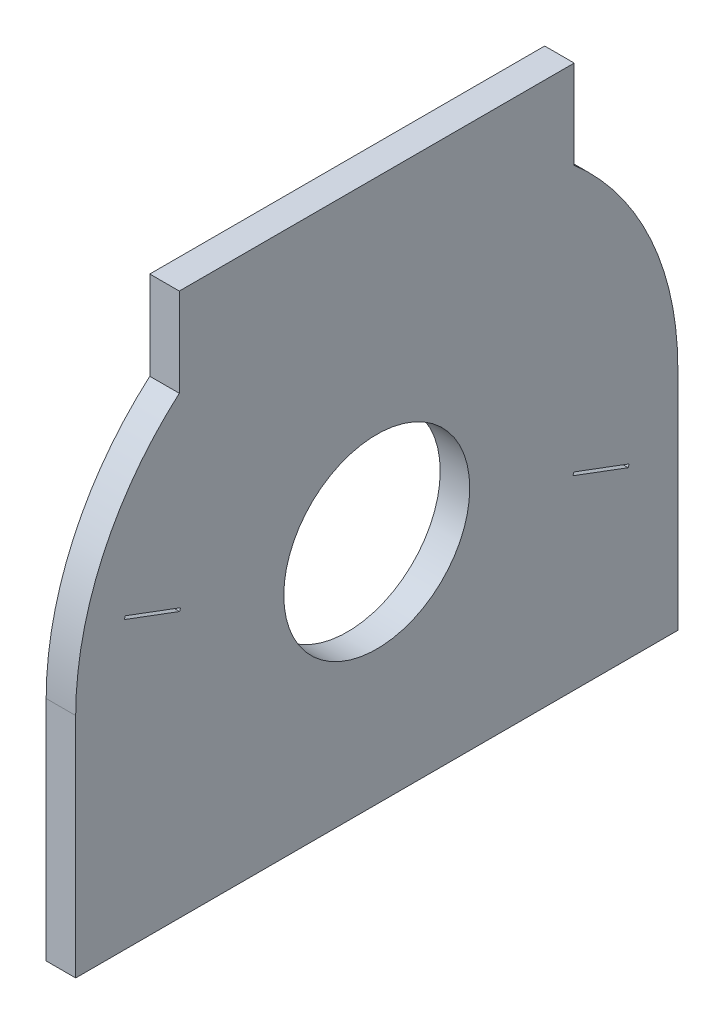
ISO-10303-21;
HEADER;
FILE_DESCRIPTION(('STEP AP214'),'2;1');
FILE_NAME('part.step','',(''),(''),'','','');
FILE_SCHEMA(('AUTOMOTIVE_DESIGN { 1 0 10303 214 1 1 1 1 }'));
ENDSEC;
DATA;
#1=APPLICATION_CONTEXT('core data for automotive mechanical design processes');
#2=APPLICATION_PROTOCOL_DEFINITION('international standard','automotive_design',2000,#1);
#3=PRODUCT_CONTEXT('',#1,'mechanical');
#4=PRODUCT('Part','Part','',(#3));
#5=PRODUCT_RELATED_PRODUCT_CATEGORY('part','',(#4));
#6=PRODUCT_DEFINITION_FORMATION('','',#4);
#7=PRODUCT_DEFINITION_CONTEXT('part definition',#1,'design');
#8=PRODUCT_DEFINITION('design','',#6,#7);
#9=PRODUCT_DEFINITION_SHAPE('','',#8);
#10=(LENGTH_UNIT() NAMED_UNIT(*) SI_UNIT(.MILLI.,.METRE.));
#11=(NAMED_UNIT(*) PLANE_ANGLE_UNIT() SI_UNIT($,.RADIAN.));
#12=(NAMED_UNIT(*) SI_UNIT($,.STERADIAN.) SOLID_ANGLE_UNIT());
#13=UNCERTAINTY_MEASURE_WITH_UNIT(LENGTH_MEASURE(1.E-05),#10,'distance_accuracy_value','');
#14=(GEOMETRIC_REPRESENTATION_CONTEXT(3) GLOBAL_UNCERTAINTY_ASSIGNED_CONTEXT((#13)) GLOBAL_UNIT_ASSIGNED_CONTEXT((#10,
#11,#12)) REPRESENTATION_CONTEXT('',''));
#15=CARTESIAN_POINT('',(0.,0.,0.));
#16=DIRECTION('',(0.,0.,1.));
#17=DIRECTION('',(1.,0.,0.));
#18=AXIS2_PLACEMENT_3D('',#15,#16,#17);
#19=CARTESIAN_POINT('',(-13.55,-11.6,0.));
#20=DIRECTION('',(-1.,0.,0.));
#21=DIRECTION('',(0.,0.,1.));
#22=AXIS2_PLACEMENT_3D('',#19,#20,#21);
#23=PLANE('',#22);
#24=CARTESIAN_POINT('',(-13.55,-11.6,0.));
#25=DIRECTION('',(-1.,0.,0.));
#26=DIRECTION('',(0.,0.,1.));
#27=AXIS2_PLACEMENT_3D('',#24,#25,#26);
#28=CIRCLE('',#27,3.15);
#29=CARTESIAN_POINT('',(-13.55,-11.6,3.15));
#30=VERTEX_POINT('',#29);
#31=EDGE_CURVE('E19',#30,#30,#28,.F.);
#32=ORIENTED_EDGE('',*,*,#31,.T.);
#33=EDGE_LOOP('',(#32));
#34=FACE_BOUND('',#33,.T.);
#35=DIRECTION('',(0.,0.936672189248387,-0.350207381259495));
#36=VECTOR('',#35,1.);
#37=CARTESIAN_POINT('',(-13.55,-9.512959009278,8.519161820185));
#38=LINE('',#37,#36);
#39=CARTESIAN_POINT('',(-13.55,-9.606626228203,8.55418255831101));
#40=VERTEX_POINT('',#39);
#41=CARTESIAN_POINT('',(-13.55,-9.51295900927981,8.51916182018568));
#42=VERTEX_POINT('',#41);
#43=EDGE_CURVE('E211',#40,#42,#38,.T.);
#44=ORIENTED_EDGE('',*,*,#43,.F.);
#45=DIRECTION('',(0.,0.350207381259495,0.936672189248387));
#46=VECTOR('',#45,1.);
#47=CARTESIAN_POINT('',(-13.55,-9.606626228203,8.554182558311));
#48=LINE('',#47,#46);
#49=CARTESIAN_POINT('',(-13.55,-10.3070409907207,6.68083817981524));
#50=VERTEX_POINT('',#49);
#51=EDGE_CURVE('E195',#50,#40,#48,.T.);
#52=ORIENTED_EDGE('',*,*,#51,.F.);
#53=DIRECTION('',(0.,-0.936672189248387,0.350207381259495));
#54=VECTOR('',#53,1.);
#55=CARTESIAN_POINT('',(-13.55,-10.30704099072,6.680838179815));
#56=LINE('',#55,#54);
#57=CARTESIAN_POINT('',(-13.55,-10.2133737717996,6.64581744169002));
#58=VERTEX_POINT('',#57);
#59=EDGE_CURVE('E92',#58,#50,#56,.T.);
#60=ORIENTED_EDGE('',*,*,#59,.F.);
#61=DIRECTION('',(0.,-0.350207381259495,-0.936672189248387));
#62=VECTOR('',#61,1.);
#63=CARTESIAN_POINT('',(-13.55,-10.2133737718,6.645817441689));
#64=LINE('',#63,#62);
#65=EDGE_CURVE('E217',#42,#58,#64,.T.);
#66=ORIENTED_EDGE('',*,*,#65,.F.);
#67=EDGE_LOOP('',(#44,#52,#60,#66));
#68=FACE_BOUND('',#67,.T.);
#69=DIRECTION('',(0.,0.936672189248387,-0.350207381259495));
#70=VECTOR('',#69,1.);
#71=CARTESIAN_POINT('',(-13.55,-12.89295900928,-6.680838179815));
#72=LINE('',#71,#70);
#73=CARTESIAN_POINT('',(-13.55,-12.9866262282004,-6.64581744169002));
#74=VERTEX_POINT('',#73);
#75=CARTESIAN_POINT('',(-13.55,-12.8929590092807,-6.68083817981473));
#76=VERTEX_POINT('',#75);
#77=EDGE_CURVE('E230',#74,#76,#72,.T.);
#78=ORIENTED_EDGE('',*,*,#77,.F.);
#79=DIRECTION('',(0.,0.350207381259495,0.936672189248387));
#80=VECTOR('',#79,1.);
#81=CARTESIAN_POINT('',(-13.55,-12.9866262282,-6.645817441689));
#82=LINE('',#81,#80);
#83=CARTESIAN_POINT('',(-13.55,-13.6870409907195,-8.51916182018518));
#84=VERTEX_POINT('',#83);
#85=EDGE_CURVE('E121',#84,#74,#82,.T.);
#86=ORIENTED_EDGE('',*,*,#85,.F.);
#87=DIRECTION('',(0.,-0.936672189248387,0.350207381259495));
#88=VECTOR('',#87,1.);
#89=CARTESIAN_POINT('',(-13.55,-13.68704099072,-8.519161820185));
#90=LINE('',#89,#88);
#91=CARTESIAN_POINT('',(-13.55,-13.5933737717996,-8.55418255830998));
#92=VERTEX_POINT('',#91);
#93=EDGE_CURVE('E118',#92,#84,#90,.T.);
#94=ORIENTED_EDGE('',*,*,#93,.F.);
#95=DIRECTION('',(0.,-0.350207381259495,-0.936672189248387));
#96=VECTOR('',#95,1.);
#97=CARTESIAN_POINT('',(-13.55,-13.5933737718,-8.554182558311));
#98=LINE('',#97,#96);
#99=EDGE_CURVE('E115',#76,#92,#98,.T.);
#100=ORIENTED_EDGE('',*,*,#99,.F.);
#101=EDGE_LOOP('',(#78,#86,#94,#100));
#102=FACE_BOUND('',#101,.T.);
#103=CARTESIAN_POINT('',(-13.55,-11.6,0.));
#104=DIRECTION('',(-1.,0.,0.));
#105=DIRECTION('',(0.,0.,1.));
#106=AXIS2_PLACEMENT_3D('',#103,#104,#105);
#107=CIRCLE('',#106,10.2);
#108=CARTESIAN_POINT('',(-13.55,-11.6,-10.2));
#109=VERTEX_POINT('',#108);
#110=CARTESIAN_POINT('',(-13.55,-3.90000000000013,-6.68954408012998));
#111=VERTEX_POINT('',#110);
#112=EDGE_CURVE('E188',#109,#111,#107,.F.);
#113=ORIENTED_EDGE('',*,*,#112,.F.);
#114=DIRECTION('',(0.,1.,0.));
#115=VECTOR('',#114,1.);
#116=CARTESIAN_POINT('',(-13.55,-22.9,-10.2));
#117=LINE('',#116,#115);
#118=CARTESIAN_POINT('',(-13.55,-19.3,-10.2));
#119=VERTEX_POINT('',#118);
#120=EDGE_CURVE('E154',#119,#109,#117,.T.);
#121=ORIENTED_EDGE('',*,*,#120,.F.);
#122=DIRECTION('',(0.,0.,1.));
#123=VECTOR('',#122,1.);
#124=CARTESIAN_POINT('',(-13.55,-19.3,14.3153457059952));
#125=LINE('',#124,#123);
#126=CARTESIAN_POINT('',(-13.55,-19.3,10.2));
#127=VERTEX_POINT('',#126);
#128=EDGE_CURVE('E149',#119,#127,#125,.T.);
#129=ORIENTED_EDGE('',*,*,#128,.T.);
#130=DIRECTION('',(0.,1.,0.));
#131=VECTOR('',#130,1.);
#132=CARTESIAN_POINT('',(-13.55,-11.6,10.2));
#133=LINE('',#132,#131);
#134=CARTESIAN_POINT('',(-13.55,-11.6,10.2));
#135=VERTEX_POINT('',#134);
#136=EDGE_CURVE('E144',#135,#127,#133,.F.);
#137=ORIENTED_EDGE('',*,*,#136,.F.);
#138=CARTESIAN_POINT('',(-13.55,-11.6,0.));
#139=DIRECTION('',(-1.,0.,0.));
#140=DIRECTION('',(0.,0.,1.));
#141=AXIS2_PLACEMENT_3D('',#138,#139,#140);
#142=CIRCLE('',#141,10.2);
#143=CARTESIAN_POINT('',(-13.55,-3.90000000000011,6.68954408013));
#144=VERTEX_POINT('',#143);
#145=EDGE_CURVE('E172',#144,#135,#142,.F.);
#146=ORIENTED_EDGE('',*,*,#145,.F.);
#147=DIRECTION('',(0.,1.,0.));
#148=VECTOR('',#147,1.);
#149=CARTESIAN_POINT('',(-13.55,-3.9,6.68954408013));
#150=LINE('',#149,#148);
#151=CARTESIAN_POINT('',(-13.55,-0.9,6.68954408013));
#152=VERTEX_POINT('',#151);
#153=EDGE_CURVE('E83',#152,#144,#150,.F.);
#154=ORIENTED_EDGE('',*,*,#153,.F.);
#155=DIRECTION('',(0.,0.,1.));
#156=VECTOR('',#155,1.);
#157=CARTESIAN_POINT('',(-13.55,-0.9,6.68954408013));
#158=LINE('',#157,#156);
#159=CARTESIAN_POINT('',(-13.55,-0.9,-6.68954408013));
#160=VERTEX_POINT('',#159);
#161=EDGE_CURVE('E166',#160,#152,#158,.T.);
#162=ORIENTED_EDGE('',*,*,#161,.F.);
#163=DIRECTION('',(0.,1.,0.));
#164=VECTOR('',#163,1.);
#165=CARTESIAN_POINT('',(-13.55,-0.9,-6.68954408013));
#166=LINE('',#165,#164);
#167=EDGE_CURVE('E160',#111,#160,#166,.T.);
#168=ORIENTED_EDGE('',*,*,#167,.F.);
#169=EDGE_LOOP('',(#113,#121,#129,#137,#146,#154,#162,#168));
#170=FACE_BOUND('',#169,.T.);
#171=ADVANCED_FACE('F16',(#34,#68,#102,#170),#23,.T.);
#172=CARTESIAN_POINT('',(-12.55,-13.68704099072,-8.519161820185));
#173=DIRECTION('',(0.,0.350207381259495,0.936672189248387));
#174=DIRECTION('',(0.,-0.936672189248387,0.350207381259495));
#175=AXIS2_PLACEMENT_3D('',#172,#173,#174);
#176=PLANE('',#175);
#177=DIRECTION('',(1.,0.,0.));
#178=VECTOR('',#177,1.);
#179=CARTESIAN_POINT('',(-12.55,-13.5933737717998,-8.55418255831059));
#180=LINE('',#179,#178);
#181=CARTESIAN_POINT('',(-12.55,-13.5933737717996,-8.55418255830998));
#182=VERTEX_POINT('',#181);
#183=EDGE_CURVE('E126',#92,#182,#180,.T.);
#184=ORIENTED_EDGE('',*,*,#183,.F.);
#185=ORIENTED_EDGE('',*,*,#93,.T.);
#186=DIRECTION('',(1.,0.,0.));
#187=VECTOR('',#186,1.);
#188=CARTESIAN_POINT('',(-12.55,-13.6870409907189,-8.51916182018543));
#189=LINE('',#188,#187);
#190=CARTESIAN_POINT('',(-12.55,-13.6870409907194,-8.51916182018521));
#191=VERTEX_POINT('',#190);
#192=EDGE_CURVE('E225',#191,#84,#189,.F.);
#193=ORIENTED_EDGE('',*,*,#192,.F.);
#194=DIRECTION('',(0.,0.936672189243805,-0.35020738127175));
#195=VECTOR('',#194,1.);
#196=CARTESIAN_POINT('',(-12.55,-13.6870409907194,-8.51916182018521));
#197=LINE('',#196,#195);
#198=EDGE_CURVE('E140',#191,#182,#197,.T.);
#199=ORIENTED_EDGE('',*,*,#198,.T.);
#200=EDGE_LOOP('',(#184,#185,#193,#199));
#201=FACE_BOUND('',#200,.T.);
#202=ADVANCED_FACE('F138',(#201),#176,.T.);
#203=CARTESIAN_POINT('',(-12.55,-13.5933737718,-8.554182558311));
#204=DIRECTION('',(0.,-0.936672189248387,0.350207381259495));
#205=DIRECTION('',(0.,-0.350207381259495,-0.936672189248387));
#206=AXIS2_PLACEMENT_3D('',#203,#204,#205);
#207=PLANE('',#206);
#208=DIRECTION('',(1.,0.,0.));
#209=VECTOR('',#208,1.);
#210=CARTESIAN_POINT('',(-12.55,-12.8929590092803,-6.68083817981489));
#211=LINE('',#210,#209);
#212=CARTESIAN_POINT('',(-12.55,-12.8929590092808,-6.68083817981471));
#213=VERTEX_POINT('',#212);
#214=EDGE_CURVE('E135',#76,#213,#211,.T.);
#215=ORIENTED_EDGE('',*,*,#214,.F.);
#216=ORIENTED_EDGE('',*,*,#99,.T.);
#217=ORIENTED_EDGE('',*,*,#183,.T.);
#218=DIRECTION('',(0.,0.35020738125978,0.936672189248281));
#219=VECTOR('',#218,1.);
#220=CARTESIAN_POINT('',(-12.55,-13.5933737717998,-8.55418255831059));
#221=LINE('',#220,#219);
#222=EDGE_CURVE('E243',#182,#213,#221,.T.);
#223=ORIENTED_EDGE('',*,*,#222,.T.);
#224=EDGE_LOOP('',(#215,#216,#217,#223));
#225=FACE_BOUND('',#224,.T.);
#226=ADVANCED_FACE('F131',(#225),#207,.T.);
#227=CARTESIAN_POINT('',(-12.55,-12.89295900928,-6.680838179815));
#228=DIRECTION('',(0.,-0.350207381259495,-0.936672189248387));
#229=DIRECTION('',(0.,0.936672189248387,-0.350207381259495));
#230=AXIS2_PLACEMENT_3D('',#227,#228,#229);
#231=PLANE('',#230);
#232=DIRECTION('',(1.,0.,0.));
#233=VECTOR('',#232,1.);
#234=CARTESIAN_POINT('',(-12.55,-12.9866262282002,-6.64581744168941));
#235=LINE('',#234,#233);
#236=CARTESIAN_POINT('',(-12.55,-12.9866262282004,-6.64581744169012));
#237=VERTEX_POINT('',#236);
#238=EDGE_CURVE('E227',#74,#237,#235,.T.);
#239=ORIENTED_EDGE('',*,*,#238,.F.);
#240=ORIENTED_EDGE('',*,*,#77,.T.);
#241=ORIENTED_EDGE('',*,*,#214,.T.);
#242=DIRECTION('',(0.,-0.936672189245345,0.350207381267631));
#243=VECTOR('',#242,1.);
#244=CARTESIAN_POINT('',(-12.55,-12.8929590092806,-6.68083817981479));
#245=LINE('',#244,#243);
#246=EDGE_CURVE('E238',#213,#237,#245,.T.);
#247=ORIENTED_EDGE('',*,*,#246,.T.);
#248=EDGE_LOOP('',(#239,#240,#241,#247));
#249=FACE_BOUND('',#248,.T.);
#250=ADVANCED_FACE('F236',(#249),#231,.T.);
#251=CARTESIAN_POINT('',(-12.55,-12.9866262282,-6.645817441689));
#252=DIRECTION('',(0.,0.936672189248387,-0.350207381259495));
#253=DIRECTION('',(0.,0.350207381259495,0.936672189248387));
#254=AXIS2_PLACEMENT_3D('',#251,#252,#253);
#255=PLANE('',#254);
#256=ORIENTED_EDGE('',*,*,#192,.T.);
#257=ORIENTED_EDGE('',*,*,#85,.T.);
#258=ORIENTED_EDGE('',*,*,#238,.T.);
#259=DIRECTION('',(0.,-0.350207381259779,-0.936672189248281));
#260=VECTOR('',#259,1.);
#261=CARTESIAN_POINT('',(-12.55,-12.9866262282003,-6.64581744168982));
#262=LINE('',#261,#260);
#263=EDGE_CURVE('E245',#237,#191,#262,.T.);
#264=ORIENTED_EDGE('',*,*,#263,.T.);
#265=EDGE_LOOP('',(#256,#257,#258,#264));
#266=FACE_BOUND('',#265,.T.);
#267=ADVANCED_FACE('F307',(#266),#255,.T.);
#268=CARTESIAN_POINT('',(-12.55,-10.30704099072,6.680838179815));
#269=DIRECTION('',(0.,0.350207381259495,0.936672189248387));
#270=DIRECTION('',(0.,-0.936672189248387,0.350207381259495));
#271=AXIS2_PLACEMENT_3D('',#268,#269,#270);
#272=PLANE('',#271);
#273=DIRECTION('',(1.,0.,0.));
#274=VECTOR('',#273,1.);
#275=CARTESIAN_POINT('',(-12.55,-10.2133737717998,6.64581744168941));
#276=LINE('',#275,#274);
#277=CARTESIAN_POINT('',(-12.55,-10.2133737717996,6.64581744169002));
#278=VERTEX_POINT('',#277);
#279=EDGE_CURVE('E220',#58,#278,#276,.T.);
#280=ORIENTED_EDGE('',*,*,#279,.F.);
#281=ORIENTED_EDGE('',*,*,#59,.T.);
#282=DIRECTION('',(1.,0.,0.));
#283=VECTOR('',#282,1.);
#284=CARTESIAN_POINT('',(-12.55,-10.3070409907215,6.68083817981556));
#285=LINE('',#284,#283);
#286=CARTESIAN_POINT('',(-12.55,-10.3070409907207,6.68083817981528));
#287=VERTEX_POINT('',#286);
#288=EDGE_CURVE('E199',#287,#50,#285,.F.);
#289=ORIENTED_EDGE('',*,*,#288,.F.);
#290=DIRECTION('',(0.,0.93667218924381,-0.350207381271738));
#291=VECTOR('',#290,1.);
#292=CARTESIAN_POINT('',(-12.55,-10.3070409907207,6.68083817981528));
#293=LINE('',#292,#291);
#294=EDGE_CURVE('E303',#287,#278,#293,.T.);
#295=ORIENTED_EDGE('',*,*,#294,.T.);
#296=EDGE_LOOP('',(#280,#281,#289,#295));
#297=FACE_BOUND('',#296,.T.);
#298=ADVANCED_FACE('F327',(#297),#272,.T.);
#299=CARTESIAN_POINT('',(-12.55,-10.2133737718,6.645817441689));
#300=DIRECTION('',(0.,-0.936672189248387,0.350207381259495));
#301=DIRECTION('',(0.,-0.350207381259495,-0.936672189248387));
#302=AXIS2_PLACEMENT_3D('',#299,#300,#301);
#303=PLANE('',#302);
#304=DIRECTION('',(1.,0.,0.));
#305=VECTOR('',#304,1.);
#306=CARTESIAN_POINT('',(-12.55,-9.51295900927872,8.51916182018527));
#307=LINE('',#306,#305);
#308=CARTESIAN_POINT('',(-12.55,-9.51295900927999,8.51916182018574));
#309=VERTEX_POINT('',#308);
#310=EDGE_CURVE('E214',#42,#309,#307,.T.);
#311=ORIENTED_EDGE('',*,*,#310,.F.);
#312=ORIENTED_EDGE('',*,*,#65,.T.);
#313=ORIENTED_EDGE('',*,*,#279,.T.);
#314=DIRECTION('',(0.,0.350207381260219,0.936672189248117));
#315=VECTOR('',#314,1.);
#316=CARTESIAN_POINT('',(-12.55,-10.2133737717998,6.64581744168941));
#317=LINE('',#316,#315);
#318=EDGE_CURVE('E300',#278,#309,#317,.T.);
#319=ORIENTED_EDGE('',*,*,#318,.T.);
#320=EDGE_LOOP('',(#311,#312,#313,#319));
#321=FACE_BOUND('',#320,.T.);
#322=ADVANCED_FACE('F326',(#321),#303,.T.);
#323=CARTESIAN_POINT('',(-12.55,-9.512959009278,8.519161820185));
#324=DIRECTION('',(0.,-0.350207381259495,-0.936672189248387));
#325=DIRECTION('',(0.,0.936672189248387,-0.350207381259495));
#326=AXIS2_PLACEMENT_3D('',#323,#324,#325);
#327=PLANE('',#326);
#328=DIRECTION('',(1.,0.,0.));
#329=VECTOR('',#328,1.);
#330=CARTESIAN_POINT('',(-12.55,-9.606626228203,8.554182558311));
#331=LINE('',#330,#329);
#332=CARTESIAN_POINT('',(-12.55,-9.606626228203,8.55418255831101));
#333=VERTEX_POINT('',#332);
#334=EDGE_CURVE('E205',#40,#333,#331,.T.);
#335=ORIENTED_EDGE('',*,*,#334,.F.);
#336=ORIENTED_EDGE('',*,*,#43,.T.);
#337=ORIENTED_EDGE('',*,*,#310,.T.);
#338=DIRECTION('',(0.,-0.936672189248402,0.350207381259455));
#339=VECTOR('',#338,1.);
#340=CARTESIAN_POINT('',(-12.55,-9.51295900927945,8.51916182018554));
#341=LINE('',#340,#339);
#342=EDGE_CURVE('E297',#309,#333,#341,.T.);
#343=ORIENTED_EDGE('',*,*,#342,.T.);
#344=EDGE_LOOP('',(#335,#336,#337,#343));
#345=FACE_BOUND('',#344,.T.);
#346=ADVANCED_FACE('F323',(#345),#327,.T.);
#347=CARTESIAN_POINT('',(-12.55,-9.606626228203,8.554182558311));
#348=DIRECTION('',(0.,0.936672189248387,-0.350207381259495));
#349=DIRECTION('',(0.,0.350207381259495,0.936672189248387));
#350=AXIS2_PLACEMENT_3D('',#347,#348,#349);
#351=PLANE('',#350);
#352=ORIENTED_EDGE('',*,*,#288,.T.);
#353=ORIENTED_EDGE('',*,*,#51,.T.);
#354=ORIENTED_EDGE('',*,*,#334,.T.);
#355=DIRECTION('',(0.,-0.350207381259122,-0.936672189248527));
#356=VECTOR('',#355,1.);
#357=CARTESIAN_POINT('',(-12.55,-9.606626228203,8.554182558311));
#358=LINE('',#357,#356);
#359=EDGE_CURVE('E187',#333,#287,#358,.T.);
#360=ORIENTED_EDGE('',*,*,#359,.T.);
#361=EDGE_LOOP('',(#352,#353,#354,#360));
#362=FACE_BOUND('',#361,.T.);
#363=ADVANCED_FACE('F318',(#362),#351,.T.);
#364=CARTESIAN_POINT('',(-12.55,-11.6,0.));
#365=DIRECTION('',(-1.,0.,0.));
#366=DIRECTION('',(0.,0.,1.));
#367=AXIS2_PLACEMENT_3D('',#364,#365,#366);
#368=CYLINDRICAL_SURFACE('',#367,3.15);
#369=ORIENTED_EDGE('',*,*,#31,.F.);
#370=EDGE_LOOP('',(#369));
#371=FACE_BOUND('',#370,.T.);
#372=CARTESIAN_POINT('',(-12.55,-11.6,0.));
#373=DIRECTION('',(-1.,0.,0.));
#374=DIRECTION('',(0.,0.,1.));
#375=AXIS2_PLACEMENT_3D('',#372,#373,#374);
#376=CIRCLE('',#375,3.15);
#377=CARTESIAN_POINT('',(-12.55,-11.6,3.15));
#378=VERTEX_POINT('',#377);
#379=EDGE_CURVE('E184',#378,#378,#376,.F.);
#380=ORIENTED_EDGE('',*,*,#379,.T.);
#381=EDGE_LOOP('',(#380));
#382=FACE_BOUND('',#381,.T.);
#383=ADVANCED_FACE('F365',(#371,#382),#368,.F.);
#384=CARTESIAN_POINT('',(-12.55,-11.6,0.));
#385=DIRECTION('',(-1.,0.,0.));
#386=DIRECTION('',(0.,0.,1.));
#387=AXIS2_PLACEMENT_3D('',#384,#385,#386);
#388=CYLINDRICAL_SURFACE('',#387,10.2);
#389=CARTESIAN_POINT('',(-12.55,-11.6,0.));
#390=DIRECTION('',(-1.,0.,0.));
#391=DIRECTION('',(0.,0.,1.));
#392=AXIS2_PLACEMENT_3D('',#389,#390,#391);
#393=CIRCLE('',#392,10.2);
#394=CARTESIAN_POINT('',(-12.55,-11.6,10.2));
#395=VERTEX_POINT('',#394);
#396=CARTESIAN_POINT('',(-12.55,-3.90000000000011,6.68954408013));
#397=VERTEX_POINT('',#396);
#398=EDGE_CURVE('E180',#395,#397,#393,.T.);
#399=ORIENTED_EDGE('',*,*,#398,.T.);
#400=DIRECTION('',(1.,0.,0.));
#401=VECTOR('',#400,1.);
#402=CARTESIAN_POINT('',(-13.55,-3.90000000000008,6.68954408013));
#403=LINE('',#402,#401);
#404=EDGE_CURVE('E168',#144,#397,#403,.T.);
#405=ORIENTED_EDGE('',*,*,#404,.F.);
#406=ORIENTED_EDGE('',*,*,#145,.T.);
#407=DIRECTION('',(1.,0.,0.));
#408=VECTOR('',#407,1.);
#409=CARTESIAN_POINT('',(-12.55,-11.6,10.2));
#410=LINE('',#409,#408);
#411=EDGE_CURVE('E146',#395,#135,#410,.F.);
#412=ORIENTED_EDGE('',*,*,#411,.F.);
#413=EDGE_LOOP('',(#399,#405,#406,#412));
#414=FACE_BOUND('',#413,.T.);
#415=ADVANCED_FACE('F362',(#414),#388,.T.);
#416=CARTESIAN_POINT('',(-13.55,-3.9,6.68954408013));
#417=DIRECTION('',(0.,0.,1.));
#418=DIRECTION('',(1.,0.,0.));
#419=AXIS2_PLACEMENT_3D('',#416,#417,#418);
#420=PLANE('',#419);
#421=DIRECTION('',(0.,1.,0.));
#422=VECTOR('',#421,1.);
#423=CARTESIAN_POINT('',(-12.55,-11.6,6.68954408013));
#424=LINE('',#423,#422);
#425=CARTESIAN_POINT('',(-12.55,-0.9,6.68954408013));
#426=VERTEX_POINT('',#425);
#427=EDGE_CURVE('E183',#397,#426,#424,.T.);
#428=ORIENTED_EDGE('',*,*,#427,.T.);
#429=DIRECTION('',(1.,0.,0.));
#430=VECTOR('',#429,1.);
#431=CARTESIAN_POINT('',(-13.55,-0.9,6.68954408013));
#432=LINE('',#431,#430);
#433=EDGE_CURVE('E163',#152,#426,#432,.T.);
#434=ORIENTED_EDGE('',*,*,#433,.F.);
#435=ORIENTED_EDGE('',*,*,#153,.T.);
#436=ORIENTED_EDGE('',*,*,#404,.T.);
#437=EDGE_LOOP('',(#428,#434,#435,#436));
#438=FACE_BOUND('',#437,.T.);
#439=ADVANCED_FACE('F287',(#438),#420,.T.);
#440=CARTESIAN_POINT('',(-13.55,-0.9,6.68954408013));
#441=DIRECTION('',(0.,1.,0.));
#442=DIRECTION('',(0.,0.,1.));
#443=AXIS2_PLACEMENT_3D('',#440,#441,#442);
#444=PLANE('',#443);
#445=ORIENTED_EDGE('',*,*,#433,.T.);
#446=DIRECTION('',(0.,0.,1.));
#447=VECTOR('',#446,1.);
#448=CARTESIAN_POINT('',(-12.55,-0.9,0.));
#449=LINE('',#448,#447);
#450=CARTESIAN_POINT('',(-12.55,-0.9,-6.68954408013));
#451=VERTEX_POINT('',#450);
#452=EDGE_CURVE('E268',#426,#451,#449,.F.);
#453=ORIENTED_EDGE('',*,*,#452,.T.);
#454=DIRECTION('',(-1.,0.,0.));
#455=VECTOR('',#454,1.);
#456=CARTESIAN_POINT('',(-13.55,-0.9,-6.68954408013));
#457=LINE('',#456,#455);
#458=EDGE_CURVE('E162',#160,#451,#457,.F.);
#459=ORIENTED_EDGE('',*,*,#458,.F.);
#460=ORIENTED_EDGE('',*,*,#161,.T.);
#461=EDGE_LOOP('',(#445,#453,#459,#460));
#462=FACE_BOUND('',#461,.T.);
#463=ADVANCED_FACE('F276',(#462),#444,.T.);
#464=CARTESIAN_POINT('',(-13.55,-0.9,-6.68954408013));
#465=DIRECTION('',(0.,0.,-1.));
#466=DIRECTION('',(-1.,0.,0.));
#467=AXIS2_PLACEMENT_3D('',#464,#465,#466);
#468=PLANE('',#467);
#469=ORIENTED_EDGE('',*,*,#167,.T.);
#470=ORIENTED_EDGE('',*,*,#458,.T.);
#471=DIRECTION('',(0.,1.,0.));
#472=VECTOR('',#471,1.);
#473=CARTESIAN_POINT('',(-12.55,-11.6,-6.68954408013));
#474=LINE('',#473,#472);
#475=CARTESIAN_POINT('',(-12.55,-3.90000000000014,-6.68954408012998));
#476=VERTEX_POINT('',#475);
#477=EDGE_CURVE('E179',#451,#476,#474,.F.);
#478=ORIENTED_EDGE('',*,*,#477,.T.);
#479=DIRECTION('',(-1.,0.,0.));
#480=VECTOR('',#479,1.);
#481=CARTESIAN_POINT('',(-12.55,-3.90000000000012,-6.68954408012996));
#482=LINE('',#481,#480);
#483=EDGE_CURVE('E157',#111,#476,#482,.F.);
#484=ORIENTED_EDGE('',*,*,#483,.F.);
#485=EDGE_LOOP('',(#469,#470,#478,#484));
#486=FACE_BOUND('',#485,.T.);
#487=ADVANCED_FACE('F353',(#486),#468,.T.);
#488=CARTESIAN_POINT('',(-12.55,-11.6,0.));
#489=DIRECTION('',(-1.,0.,0.));
#490=DIRECTION('',(0.,0.,1.));
#491=AXIS2_PLACEMENT_3D('',#488,#489,#490);
#492=CYLINDRICAL_SURFACE('',#491,10.2);
#493=ORIENTED_EDGE('',*,*,#112,.T.);
#494=ORIENTED_EDGE('',*,*,#483,.T.);
#495=CARTESIAN_POINT('',(-12.55,-11.6,0.));
#496=DIRECTION('',(-1.,0.,0.));
#497=DIRECTION('',(0.,0.,1.));
#498=AXIS2_PLACEMENT_3D('',#495,#496,#497);
#499=CIRCLE('',#498,10.2);
#500=CARTESIAN_POINT('',(-12.55,-11.6,-10.2));
#501=VERTEX_POINT('',#500);
#502=EDGE_CURVE('E175',#476,#501,#499,.T.);
#503=ORIENTED_EDGE('',*,*,#502,.T.);
#504=DIRECTION('',(-1.,0.,0.));
#505=VECTOR('',#504,1.);
#506=CARTESIAN_POINT('',(-12.55,-11.6,-10.2));
#507=LINE('',#506,#505);
#508=EDGE_CURVE('E156',#109,#501,#507,.F.);
#509=ORIENTED_EDGE('',*,*,#508,.F.);
#510=EDGE_LOOP('',(#493,#494,#503,#509));
#511=FACE_BOUND('',#510,.T.);
#512=ADVANCED_FACE('F349',(#511),#492,.T.);
#513=CARTESIAN_POINT('',(-12.55,-22.9,-10.2));
#514=DIRECTION('',(0.,0.,-1.));
#515=DIRECTION('',(-1.,0.,0.));
#516=AXIS2_PLACEMENT_3D('',#513,#514,#515);
#517=PLANE('',#516);
#518=ORIENTED_EDGE('',*,*,#508,.T.);
#519=DIRECTION('',(0.,1.,0.));
#520=VECTOR('',#519,1.);
#521=CARTESIAN_POINT('',(-12.55,-11.6,-10.2));
#522=LINE('',#521,#520);
#523=CARTESIAN_POINT('',(-12.55,-19.3,-10.2));
#524=VERTEX_POINT('',#523);
#525=EDGE_CURVE('E178',#501,#524,#522,.F.);
#526=ORIENTED_EDGE('',*,*,#525,.T.);
#527=DIRECTION('',(1.,0.,0.));
#528=VECTOR('',#527,1.);
#529=CARTESIAN_POINT('',(26.2245314429007,-19.3,-10.2));
#530=LINE('',#529,#528);
#531=EDGE_CURVE('E151',#524,#119,#530,.F.);
#532=ORIENTED_EDGE('',*,*,#531,.T.);
#533=ORIENTED_EDGE('',*,*,#120,.T.);
#534=EDGE_LOOP('',(#518,#526,#532,#533));
#535=FACE_BOUND('',#534,.T.);
#536=ADVANCED_FACE('F345',(#535),#517,.T.);
#537=CARTESIAN_POINT('',(26.2245314429007,-19.3,14.3153457059952));
#538=DIRECTION('',(0.,1.,0.));
#539=DIRECTION('',(0.,0.,1.));
#540=AXIS2_PLACEMENT_3D('',#537,#538,#539);
#541=PLANE('',#540);
#542=ORIENTED_EDGE('',*,*,#128,.F.);
#543=ORIENTED_EDGE('',*,*,#531,.F.);
#544=DIRECTION('',(0.,0.,1.));
#545=VECTOR('',#544,1.);
#546=CARTESIAN_POINT('',(-12.55,-19.3,0.));
#547=LINE('',#546,#545);
#548=CARTESIAN_POINT('',(-12.55,-19.3,10.2));
#549=VERTEX_POINT('',#548);
#550=EDGE_CURVE('E25',#524,#549,#547,.T.);
#551=ORIENTED_EDGE('',*,*,#550,.T.);
#552=DIRECTION('',(1.,0.,0.));
#553=VECTOR('',#552,1.);
#554=CARTESIAN_POINT('',(-12.55,-19.3,10.2));
#555=LINE('',#554,#553);
#556=EDGE_CURVE('E33',#127,#549,#555,.T.);
#557=ORIENTED_EDGE('',*,*,#556,.F.);
#558=EDGE_LOOP('',(#542,#543,#551,#557));
#559=FACE_BOUND('',#558,.T.);
#560=ADVANCED_FACE('F340',(#559),#541,.F.);
#561=CARTESIAN_POINT('',(-12.55,-11.6,10.2));
#562=DIRECTION('',(0.,0.,1.));
#563=DIRECTION('',(1.,0.,0.));
#564=AXIS2_PLACEMENT_3D('',#561,#562,#563);
#565=PLANE('',#564);
#566=ORIENTED_EDGE('',*,*,#411,.T.);
#567=ORIENTED_EDGE('',*,*,#136,.T.);
#568=ORIENTED_EDGE('',*,*,#556,.T.);
#569=DIRECTION('',(0.,1.,0.));
#570=VECTOR('',#569,1.);
#571=CARTESIAN_POINT('',(-12.55,-11.6,10.2));
#572=LINE('',#571,#570);
#573=EDGE_CURVE('E11',#549,#395,#572,.T.);
#574=ORIENTED_EDGE('',*,*,#573,.T.);
#575=EDGE_LOOP('',(#566,#567,#568,#574));
#576=FACE_BOUND('',#575,.T.);
#577=ADVANCED_FACE('F335',(#576),#565,.T.);
#578=CARTESIAN_POINT('',(-12.55,-11.6,0.));
#579=DIRECTION('',(-1.,0.,0.));
#580=DIRECTION('',(0.,0.,1.));
#581=AXIS2_PLACEMENT_3D('',#578,#579,#580);
#582=PLANE('',#581);
#583=ORIENTED_EDGE('',*,*,#550,.F.);
#584=ORIENTED_EDGE('',*,*,#525,.F.);
#585=ORIENTED_EDGE('',*,*,#502,.F.);
#586=ORIENTED_EDGE('',*,*,#477,.F.);
#587=ORIENTED_EDGE('',*,*,#452,.F.);
#588=ORIENTED_EDGE('',*,*,#427,.F.);
#589=ORIENTED_EDGE('',*,*,#398,.F.);
#590=ORIENTED_EDGE('',*,*,#573,.F.);
#591=EDGE_LOOP('',(#583,#584,#585,#586,#587,#588,#589,#590));
#592=FACE_BOUND('',#591,.T.);
#593=ORIENTED_EDGE('',*,*,#379,.F.);
#594=EDGE_LOOP('',(#593));
#595=FACE_BOUND('',#594,.T.);
#596=ORIENTED_EDGE('',*,*,#342,.F.);
#597=ORIENTED_EDGE('',*,*,#318,.F.);
#598=ORIENTED_EDGE('',*,*,#294,.F.);
#599=ORIENTED_EDGE('',*,*,#359,.F.);
#600=EDGE_LOOP('',(#596,#597,#598,#599));
#601=FACE_BOUND('',#600,.T.);
#602=ORIENTED_EDGE('',*,*,#246,.F.);
#603=ORIENTED_EDGE('',*,*,#222,.F.);
#604=ORIENTED_EDGE('',*,*,#198,.F.);
#605=ORIENTED_EDGE('',*,*,#263,.F.);
#606=EDGE_LOOP('',(#602,#603,#604,#605));
#607=FACE_BOUND('',#606,.T.);
#608=ADVANCED_FACE('F242',(#592,#595,#601,#607),#582,.F.);
#609=CLOSED_SHELL('',(#171,#202,#226,#250,#267,#298,#322,#346,#363,#383,#415,#439,#463,#487,
#512,#536,#560,#577,#608));
#610=MANIFOLD_SOLID_BREP('B1',#609);
#611=ADVANCED_BREP_SHAPE_REPRESENTATION('',(#18,#610),#14);
#612=SHAPE_DEFINITION_REPRESENTATION(#9,#611);
ENDSEC;
END-ISO-10303-21;
